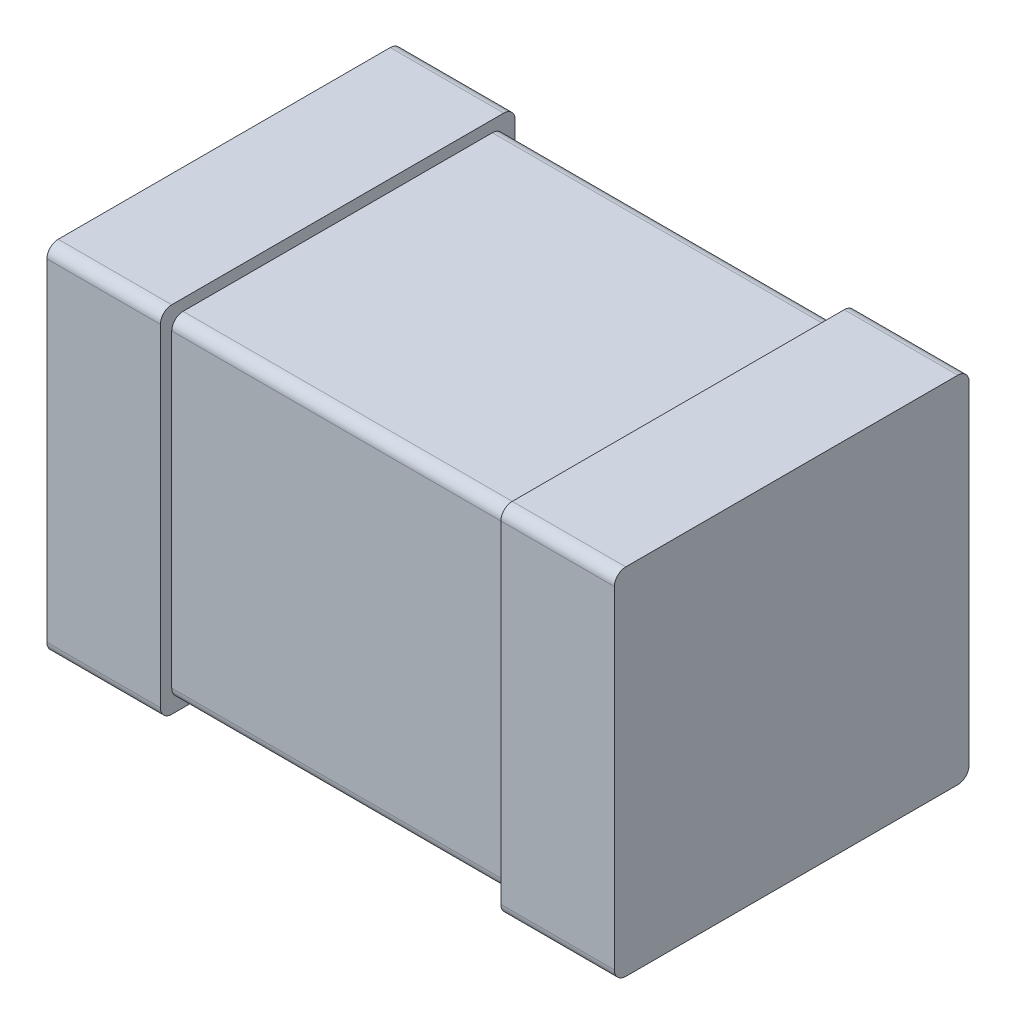
ISO-10303-21;
HEADER;
FILE_DESCRIPTION(('STEP AP214'),'2;1');
FILE_NAME('part.step','',(''),(''),'','','');
FILE_SCHEMA(('AUTOMOTIVE_DESIGN { 1 0 10303 214 1 1 1 1 }'));
ENDSEC;
DATA;
#1=APPLICATION_CONTEXT('core data for automotive mechanical design processes');
#2=APPLICATION_PROTOCOL_DEFINITION('international standard','automotive_design',2000,#1);
#3=PRODUCT_CONTEXT('',#1,'mechanical');
#4=PRODUCT('Part','Part','',(#3));
#5=PRODUCT_RELATED_PRODUCT_CATEGORY('part','',(#4));
#6=PRODUCT_DEFINITION_FORMATION('','',#4);
#7=PRODUCT_DEFINITION_CONTEXT('part definition',#1,'design');
#8=PRODUCT_DEFINITION('design','',#6,#7);
#9=PRODUCT_DEFINITION_SHAPE('','',#8);
#10=(LENGTH_UNIT() NAMED_UNIT(*) SI_UNIT(.MILLI.,.METRE.));
#11=(NAMED_UNIT(*) PLANE_ANGLE_UNIT() SI_UNIT($,.RADIAN.));
#12=(NAMED_UNIT(*) SI_UNIT($,.STERADIAN.) SOLID_ANGLE_UNIT());
#13=UNCERTAINTY_MEASURE_WITH_UNIT(LENGTH_MEASURE(1.E-05),#10,'distance_accuracy_value','');
#14=(GEOMETRIC_REPRESENTATION_CONTEXT(3) GLOBAL_UNCERTAINTY_ASSIGNED_CONTEXT((#13)) GLOBAL_UNIT_ASSIGNED_CONTEXT((#10,
#11,#12)) REPRESENTATION_CONTEXT('',''));
#15=CARTESIAN_POINT('',(0.,0.,0.));
#16=DIRECTION('',(0.,0.,1.));
#17=DIRECTION('',(1.,0.,0.));
#18=AXIS2_PLACEMENT_3D('',#15,#16,#17);
#19=CARTESIAN_POINT('',(1.,-0.625,0.));
#20=DIRECTION('',(1.,0.,0.));
#21=DIRECTION('',(0.,0.,-1.));
#22=AXIS2_PLACEMENT_3D('',#19,#20,#21);
#23=PLANE('',#22);
#24=DIRECTION('',(0.,1.,0.));
#25=VECTOR('',#24,1.);
#26=CARTESIAN_POINT('',(1.,-0.625,1.25));
#27=LINE('',#26,#25);
#28=CARTESIAN_POINT('',(1.,-0.585,1.25));
#29=VERTEX_POINT('',#28);
#30=CARTESIAN_POINT('',(1.,0.585,1.25));
#31=VERTEX_POINT('',#30);
#32=EDGE_CURVE('E200',#29,#31,#27,.T.);
#33=ORIENTED_EDGE('',*,*,#32,.F.);
#34=CARTESIAN_POINT('',(1.,-0.585,1.21));
#35=DIRECTION('',(1.,0.,0.));
#36=DIRECTION('',(0.,0.,-1.));
#37=AXIS2_PLACEMENT_3D('',#34,#35,#36);
#38=CIRCLE('',#37,0.04);
#39=CARTESIAN_POINT('',(1.,-0.625,1.21));
#40=VERTEX_POINT('',#39);
#41=EDGE_CURVE('E187',#40,#29,#38,.F.);
#42=ORIENTED_EDGE('',*,*,#41,.F.);
#43=DIRECTION('',(0.,0.,1.));
#44=VECTOR('',#43,1.);
#45=CARTESIAN_POINT('',(1.,-0.625,0.));
#46=LINE('',#45,#44);
#47=CARTESIAN_POINT('',(1.,-0.625,0.04));
#48=VERTEX_POINT('',#47);
#49=EDGE_CURVE('E184',#40,#48,#46,.F.);
#50=ORIENTED_EDGE('',*,*,#49,.T.);
#51=CARTESIAN_POINT('',(1.,-0.585,0.04));
#52=DIRECTION('',(1.,0.,0.));
#53=DIRECTION('',(0.,0.,-1.));
#54=AXIS2_PLACEMENT_3D('',#51,#52,#53);
#55=CIRCLE('',#54,0.04);
#56=CARTESIAN_POINT('',(1.,-0.585,0.));
#57=VERTEX_POINT('',#56);
#58=EDGE_CURVE('E20',#57,#48,#55,.F.);
#59=ORIENTED_EDGE('',*,*,#58,.F.);
#60=DIRECTION('',(0.,1.,0.));
#61=VECTOR('',#60,1.);
#62=CARTESIAN_POINT('',(1.,-0.625,0.));
#63=LINE('',#62,#61);
#64=CARTESIAN_POINT('',(1.,0.585,0.));
#65=VERTEX_POINT('',#64);
#66=EDGE_CURVE('E196',#57,#65,#63,.T.);
#67=ORIENTED_EDGE('',*,*,#66,.T.);
#68=CARTESIAN_POINT('',(1.,0.585,0.04));
#69=DIRECTION('',(1.,0.,0.));
#70=DIRECTION('',(0.,0.,-1.));
#71=AXIS2_PLACEMENT_3D('',#68,#69,#70);
#72=CIRCLE('',#71,0.04);
#73=CARTESIAN_POINT('',(1.,0.625,0.04));
#74=VERTEX_POINT('',#73);
#75=EDGE_CURVE('E208',#74,#65,#72,.F.);
#76=ORIENTED_EDGE('',*,*,#75,.F.);
#77=DIRECTION('',(0.,0.,1.));
#78=VECTOR('',#77,1.);
#79=CARTESIAN_POINT('',(1.,0.625,0.));
#80=LINE('',#79,#78);
#81=CARTESIAN_POINT('',(1.,0.625,1.21));
#82=VERTEX_POINT('',#81);
#83=EDGE_CURVE('E204',#82,#74,#80,.F.);
#84=ORIENTED_EDGE('',*,*,#83,.F.);
#85=CARTESIAN_POINT('',(1.,0.585,1.21));
#86=DIRECTION('',(1.,0.,0.));
#87=DIRECTION('',(0.,0.,-1.));
#88=AXIS2_PLACEMENT_3D('',#85,#86,#87);
#89=CIRCLE('',#88,0.04);
#90=EDGE_CURVE('E282',#31,#82,#89,.F.);
#91=ORIENTED_EDGE('',*,*,#90,.F.);
#92=EDGE_LOOP('',(#33,#42,#50,#59,#67,#76,#84,#91));
#93=FACE_BOUND('',#92,.T.);
#94=ADVANCED_FACE('F17',(#93),#23,.T.);
#95=CARTESIAN_POINT('',(0.6,-0.625,0.));
#96=DIRECTION('',(0.,1.,0.));
#97=DIRECTION('',(0.,0.,1.));
#98=AXIS2_PLACEMENT_3D('',#95,#96,#97);
#99=PLANE('',#98);
#100=DIRECTION('',(0.,0.,-1.));
#101=VECTOR('',#100,1.);
#102=CARTESIAN_POINT('',(0.6,-0.625,0.));
#103=LINE('',#102,#101);
#104=CARTESIAN_POINT('',(0.6,-0.625,1.21));
#105=VERTEX_POINT('',#104);
#106=CARTESIAN_POINT('',(0.6,-0.625,0.04));
#107=VERTEX_POINT('',#106);
#108=EDGE_CURVE('E194',#105,#107,#103,.T.);
#109=ORIENTED_EDGE('',*,*,#108,.T.);
#110=DIRECTION('',(1.,0.,0.));
#111=VECTOR('',#110,1.);
#112=CARTESIAN_POINT('',(0.6,-0.625,0.04));
#113=LINE('',#112,#111);
#114=EDGE_CURVE('E181',#48,#107,#113,.F.);
#115=ORIENTED_EDGE('',*,*,#114,.F.);
#116=ORIENTED_EDGE('',*,*,#49,.F.);
#117=DIRECTION('',(1.,0.,0.));
#118=VECTOR('',#117,1.);
#119=CARTESIAN_POINT('',(0.6,-0.625,1.21));
#120=LINE('',#119,#118);
#121=EDGE_CURVE('E281',#105,#40,#120,.T.);
#122=ORIENTED_EDGE('',*,*,#121,.F.);
#123=EDGE_LOOP('',(#109,#115,#116,#122));
#124=FACE_BOUND('',#123,.T.);
#125=ADVANCED_FACE('F193',(#124),#99,.F.);
#126=CARTESIAN_POINT('',(0.6,-0.585,0.04));
#127=DIRECTION('',(1.,0.,0.));
#128=DIRECTION('',(0.,0.,-1.));
#129=AXIS2_PLACEMENT_3D('',#126,#127,#128);
#130=CYLINDRICAL_SURFACE('',#129,0.04);
#131=ORIENTED_EDGE('',*,*,#58,.T.);
#132=ORIENTED_EDGE('',*,*,#114,.T.);
#133=CARTESIAN_POINT('',(0.6,-0.585,0.04));
#134=DIRECTION('',(1.,0.,0.));
#135=DIRECTION('',(0.,0.,-1.));
#136=AXIS2_PLACEMENT_3D('',#133,#134,#135);
#137=CIRCLE('',#136,0.04);
#138=CARTESIAN_POINT('',(0.6,-0.585,0.));
#139=VERTEX_POINT('',#138);
#140=EDGE_CURVE('E277',#107,#139,#137,.T.);
#141=ORIENTED_EDGE('',*,*,#140,.T.);
#142=DIRECTION('',(1.,0.,0.));
#143=VECTOR('',#142,1.);
#144=CARTESIAN_POINT('',(0.6,-0.585,0.));
#145=LINE('',#144,#143);
#146=EDGE_CURVE('E183',#139,#57,#145,.T.);
#147=ORIENTED_EDGE('',*,*,#146,.T.);
#148=EDGE_LOOP('',(#131,#132,#141,#147));
#149=FACE_BOUND('',#148,.T.);
#150=ADVANCED_FACE('F178',(#149),#130,.T.);
#151=CARTESIAN_POINT('',(0.6,-0.625,0.));
#152=DIRECTION('',(0.,0.,1.));
#153=DIRECTION('',(1.,0.,0.));
#154=AXIS2_PLACEMENT_3D('',#151,#152,#153);
#155=PLANE('',#154);
#156=ORIENTED_EDGE('',*,*,#66,.F.);
#157=ORIENTED_EDGE('',*,*,#146,.F.);
#158=DIRECTION('',(0.,1.,0.));
#159=VECTOR('',#158,1.);
#160=CARTESIAN_POINT('',(0.6,-0.625,0.));
#161=LINE('',#160,#159);
#162=CARTESIAN_POINT('',(0.6,0.585,0.));
#163=VERTEX_POINT('',#162);
#164=EDGE_CURVE('E276',#139,#163,#161,.T.);
#165=ORIENTED_EDGE('',*,*,#164,.T.);
#166=DIRECTION('',(1.,0.,0.));
#167=VECTOR('',#166,1.);
#168=CARTESIAN_POINT('',(0.6,0.585,0.));
#169=LINE('',#168,#167);
#170=EDGE_CURVE('E207',#65,#163,#169,.F.);
#171=ORIENTED_EDGE('',*,*,#170,.F.);
#172=EDGE_LOOP('',(#156,#157,#165,#171));
#173=FACE_BOUND('',#172,.T.);
#174=ADVANCED_FACE('F474',(#173),#155,.F.);
#175=CARTESIAN_POINT('',(0.6,0.585,0.04));
#176=DIRECTION('',(1.,0.,0.));
#177=DIRECTION('',(0.,0.,-1.));
#178=AXIS2_PLACEMENT_3D('',#175,#176,#177);
#179=CYLINDRICAL_SURFACE('',#178,0.04);
#180=ORIENTED_EDGE('',*,*,#170,.T.);
#181=CARTESIAN_POINT('',(0.6,0.585,0.04));
#182=DIRECTION('',(1.,0.,0.));
#183=DIRECTION('',(0.,0.,-1.));
#184=AXIS2_PLACEMENT_3D('',#181,#182,#183);
#185=CIRCLE('',#184,0.04);
#186=CARTESIAN_POINT('',(0.6,0.625,0.04));
#187=VERTEX_POINT('',#186);
#188=EDGE_CURVE('E273',#163,#187,#185,.T.);
#189=ORIENTED_EDGE('',*,*,#188,.T.);
#190=DIRECTION('',(1.,0.,0.));
#191=VECTOR('',#190,1.);
#192=CARTESIAN_POINT('',(0.6,0.625,0.04));
#193=LINE('',#192,#191);
#194=EDGE_CURVE('E206',#74,#187,#193,.F.);
#195=ORIENTED_EDGE('',*,*,#194,.F.);
#196=ORIENTED_EDGE('',*,*,#75,.T.);
#197=EDGE_LOOP('',(#180,#189,#195,#196));
#198=FACE_BOUND('',#197,.T.);
#199=ADVANCED_FACE('F470',(#198),#179,.T.);
#200=CARTESIAN_POINT('',(0.6,0.625,0.));
#201=DIRECTION('',(0.,1.,0.));
#202=DIRECTION('',(0.,0.,1.));
#203=AXIS2_PLACEMENT_3D('',#200,#201,#202);
#204=PLANE('',#203);
#205=DIRECTION('',(0.,0.,-1.));
#206=VECTOR('',#205,1.);
#207=CARTESIAN_POINT('',(0.6,0.625,0.));
#208=LINE('',#207,#206);
#209=CARTESIAN_POINT('',(0.6,0.625,1.21));
#210=VERTEX_POINT('',#209);
#211=EDGE_CURVE('E272',#187,#210,#208,.F.);
#212=ORIENTED_EDGE('',*,*,#211,.T.);
#213=DIRECTION('',(1.,0.,0.));
#214=VECTOR('',#213,1.);
#215=CARTESIAN_POINT('',(0.6,0.625,1.21));
#216=LINE('',#215,#214);
#217=EDGE_CURVE('E202',#82,#210,#216,.F.);
#218=ORIENTED_EDGE('',*,*,#217,.F.);
#219=ORIENTED_EDGE('',*,*,#83,.T.);
#220=ORIENTED_EDGE('',*,*,#194,.T.);
#221=EDGE_LOOP('',(#212,#218,#219,#220));
#222=FACE_BOUND('',#221,.T.);
#223=ADVANCED_FACE('F466',(#222),#204,.T.);
#224=CARTESIAN_POINT('',(0.6,0.585,1.21));
#225=DIRECTION('',(1.,0.,0.));
#226=DIRECTION('',(0.,0.,-1.));
#227=AXIS2_PLACEMENT_3D('',#224,#225,#226);
#228=CYLINDRICAL_SURFACE('',#227,0.04);
#229=ORIENTED_EDGE('',*,*,#90,.T.);
#230=ORIENTED_EDGE('',*,*,#217,.T.);
#231=CARTESIAN_POINT('',(0.6,0.585,1.21));
#232=DIRECTION('',(1.,0.,0.));
#233=DIRECTION('',(0.,0.,-1.));
#234=AXIS2_PLACEMENT_3D('',#231,#232,#233);
#235=CIRCLE('',#234,0.04);
#236=CARTESIAN_POINT('',(0.6,0.585,1.25));
#237=VERTEX_POINT('',#236);
#238=EDGE_CURVE('E269',#210,#237,#235,.T.);
#239=ORIENTED_EDGE('',*,*,#238,.T.);
#240=DIRECTION('',(1.,0.,0.));
#241=VECTOR('',#240,1.);
#242=CARTESIAN_POINT('',(0.6,0.585,1.25));
#243=LINE('',#242,#241);
#244=EDGE_CURVE('E201',#31,#237,#243,.F.);
#245=ORIENTED_EDGE('',*,*,#244,.F.);
#246=EDGE_LOOP('',(#229,#230,#239,#245));
#247=FACE_BOUND('',#246,.T.);
#248=ADVANCED_FACE('F462',(#247),#228,.T.);
#249=CARTESIAN_POINT('',(0.6,-0.625,1.25));
#250=DIRECTION('',(0.,0.,1.));
#251=DIRECTION('',(1.,0.,0.));
#252=AXIS2_PLACEMENT_3D('',#249,#250,#251);
#253=PLANE('',#252);
#254=ORIENTED_EDGE('',*,*,#32,.T.);
#255=ORIENTED_EDGE('',*,*,#244,.T.);
#256=DIRECTION('',(0.,1.,0.));
#257=VECTOR('',#256,1.);
#258=CARTESIAN_POINT('',(0.6,-0.625,1.25));
#259=LINE('',#258,#257);
#260=CARTESIAN_POINT('',(0.6,-0.585,1.25));
#261=VERTEX_POINT('',#260);
#262=EDGE_CURVE('E268',#237,#261,#259,.F.);
#263=ORIENTED_EDGE('',*,*,#262,.T.);
#264=DIRECTION('',(1.,0.,0.));
#265=VECTOR('',#264,1.);
#266=CARTESIAN_POINT('',(0.6,-0.585,1.25));
#267=LINE('',#266,#265);
#268=EDGE_CURVE('E280',#29,#261,#267,.F.);
#269=ORIENTED_EDGE('',*,*,#268,.F.);
#270=EDGE_LOOP('',(#254,#255,#263,#269));
#271=FACE_BOUND('',#270,.T.);
#272=ADVANCED_FACE('F458',(#271),#253,.T.);
#273=CARTESIAN_POINT('',(0.6,-0.585,1.21));
#274=DIRECTION('',(1.,0.,0.));
#275=DIRECTION('',(0.,0.,-1.));
#276=AXIS2_PLACEMENT_3D('',#273,#274,#275);
#277=CYLINDRICAL_SURFACE('',#276,0.04);
#278=ORIENTED_EDGE('',*,*,#268,.T.);
#279=CARTESIAN_POINT('',(0.6,-0.585,1.21));
#280=DIRECTION('',(1.,0.,0.));
#281=DIRECTION('',(0.,0.,-1.));
#282=AXIS2_PLACEMENT_3D('',#279,#280,#281);
#283=CIRCLE('',#282,0.04);
#284=EDGE_CURVE('E265',#261,#105,#283,.T.);
#285=ORIENTED_EDGE('',*,*,#284,.T.);
#286=ORIENTED_EDGE('',*,*,#121,.T.);
#287=ORIENTED_EDGE('',*,*,#41,.T.);
#288=EDGE_LOOP('',(#278,#285,#286,#287));
#289=FACE_BOUND('',#288,.T.);
#290=ADVANCED_FACE('F454',(#289),#277,.T.);
#291=CARTESIAN_POINT('',(0.6,-0.625,0.));
#292=DIRECTION('',(1.,0.,0.));
#293=DIRECTION('',(0.,0.,-1.));
#294=AXIS2_PLACEMENT_3D('',#291,#292,#293);
#295=PLANE('',#294);
#296=CARTESIAN_POINT('',(0.6,0.545,0.08));
#297=DIRECTION('',(1.,0.,0.));
#298=DIRECTION('',(0.,0.,-1.));
#299=AXIS2_PLACEMENT_3D('',#296,#297,#298);
#300=CIRCLE('',#299,0.04);
#301=CARTESIAN_POINT('',(0.6,0.585,0.08));
#302=VERTEX_POINT('',#301);
#303=CARTESIAN_POINT('',(0.6,0.545,0.04));
#304=VERTEX_POINT('',#303);
#305=EDGE_CURVE('E250',#302,#304,#300,.F.);
#306=ORIENTED_EDGE('',*,*,#305,.F.);
#307=DIRECTION('',(0.,0.,1.));
#308=VECTOR('',#307,1.);
#309=CARTESIAN_POINT('',(0.6,0.585,0.04));
#310=LINE('',#309,#308);
#311=CARTESIAN_POINT('',(0.6,0.585,1.17));
#312=VERTEX_POINT('',#311);
#313=EDGE_CURVE('E256',#312,#302,#310,.F.);
#314=ORIENTED_EDGE('',*,*,#313,.F.);
#315=CARTESIAN_POINT('',(0.6,0.545,1.17));
#316=DIRECTION('',(1.,0.,0.));
#317=DIRECTION('',(0.,0.,-1.));
#318=AXIS2_PLACEMENT_3D('',#315,#316,#317);
#319=CIRCLE('',#318,0.04);
#320=CARTESIAN_POINT('',(0.6,0.545,1.21));
#321=VERTEX_POINT('',#320);
#322=EDGE_CURVE('E254',#321,#312,#319,.F.);
#323=ORIENTED_EDGE('',*,*,#322,.F.);
#324=DIRECTION('',(0.,1.,0.));
#325=VECTOR('',#324,1.);
#326=CARTESIAN_POINT('',(0.6,-0.585,1.21));
#327=LINE('',#326,#325);
#328=CARTESIAN_POINT('',(0.6,-0.545,1.21));
#329=VERTEX_POINT('',#328);
#330=EDGE_CURVE('E297',#329,#321,#327,.T.);
#331=ORIENTED_EDGE('',*,*,#330,.F.);
#332=CARTESIAN_POINT('',(0.6,-0.545,1.17));
#333=DIRECTION('',(1.,0.,0.));
#334=DIRECTION('',(0.,0.,-1.));
#335=AXIS2_PLACEMENT_3D('',#332,#333,#334);
#336=CIRCLE('',#335,0.04);
#337=CARTESIAN_POINT('',(0.6,-0.585,1.17));
#338=VERTEX_POINT('',#337);
#339=EDGE_CURVE('E258',#338,#329,#336,.F.);
#340=ORIENTED_EDGE('',*,*,#339,.F.);
#341=DIRECTION('',(0.,0.,1.));
#342=VECTOR('',#341,1.);
#343=CARTESIAN_POINT('',(0.6,-0.585,0.04));
#344=LINE('',#343,#342);
#345=CARTESIAN_POINT('',(0.6,-0.585,0.08));
#346=VERTEX_POINT('',#345);
#347=EDGE_CURVE('E264',#338,#346,#344,.F.);
#348=ORIENTED_EDGE('',*,*,#347,.T.);
#349=CARTESIAN_POINT('',(0.6,-0.545,0.08));
#350=DIRECTION('',(1.,0.,0.));
#351=DIRECTION('',(0.,0.,-1.));
#352=AXIS2_PLACEMENT_3D('',#349,#350,#351);
#353=CIRCLE('',#352,0.04);
#354=CARTESIAN_POINT('',(0.6,-0.545,0.04));
#355=VERTEX_POINT('',#354);
#356=EDGE_CURVE('E262',#355,#346,#353,.F.);
#357=ORIENTED_EDGE('',*,*,#356,.F.);
#358=DIRECTION('',(0.,1.,0.));
#359=VECTOR('',#358,1.);
#360=CARTESIAN_POINT('',(0.6,-0.585,0.04));
#361=LINE('',#360,#359);
#362=EDGE_CURVE('E308',#355,#304,#361,.T.);
#363=ORIENTED_EDGE('',*,*,#362,.T.);
#364=EDGE_LOOP('',(#306,#314,#323,#331,#340,#348,#357,#363));
#365=FACE_BOUND('',#364,.T.);
#366=ORIENTED_EDGE('',*,*,#262,.F.);
#367=ORIENTED_EDGE('',*,*,#238,.F.);
#368=ORIENTED_EDGE('',*,*,#211,.F.);
#369=ORIENTED_EDGE('',*,*,#188,.F.);
#370=ORIENTED_EDGE('',*,*,#164,.F.);
#371=ORIENTED_EDGE('',*,*,#140,.F.);
#372=ORIENTED_EDGE('',*,*,#108,.F.);
#373=ORIENTED_EDGE('',*,*,#284,.F.);
#374=EDGE_LOOP('',(#366,#367,#368,#369,#370,#371,#372,#373));
#375=FACE_BOUND('',#374,.T.);
#376=ADVANCED_FACE('F450',(#365,#375),#295,.F.);
#377=CARTESIAN_POINT('',(-0.6,-0.545,0.08));
#378=DIRECTION('',(1.,0.,0.));
#379=DIRECTION('',(0.,0.,-1.));
#380=AXIS2_PLACEMENT_3D('',#377,#378,#379);
#381=CYLINDRICAL_SURFACE('',#380,0.04);
#382=ORIENTED_EDGE('',*,*,#356,.T.);
#383=DIRECTION('',(1.,0.,0.));
#384=VECTOR('',#383,1.);
#385=CARTESIAN_POINT('',(-0.6,-0.585,0.08));
#386=LINE('',#385,#384);
#387=CARTESIAN_POINT('',(-0.6,-0.585,0.08));
#388=VERTEX_POINT('',#387);
#389=EDGE_CURVE('E296',#346,#388,#386,.F.);
#390=ORIENTED_EDGE('',*,*,#389,.T.);
#391=CARTESIAN_POINT('',(-0.6,-0.545,0.08));
#392=DIRECTION('',(1.,0.,0.));
#393=DIRECTION('',(0.,0.,-1.));
#394=AXIS2_PLACEMENT_3D('',#391,#392,#393);
#395=CIRCLE('',#394,0.04);
#396=CARTESIAN_POINT('',(-0.6,-0.545,0.04));
#397=VERTEX_POINT('',#396);
#398=EDGE_CURVE('E247',#397,#388,#395,.F.);
#399=ORIENTED_EDGE('',*,*,#398,.F.);
#400=DIRECTION('',(1.,0.,0.));
#401=VECTOR('',#400,1.);
#402=CARTESIAN_POINT('',(-0.6,-0.545,0.04));
#403=LINE('',#402,#401);
#404=EDGE_CURVE('E252',#397,#355,#403,.T.);
#405=ORIENTED_EDGE('',*,*,#404,.T.);
#406=EDGE_LOOP('',(#382,#390,#399,#405));
#407=FACE_BOUND('',#406,.T.);
#408=ADVANCED_FACE('F446',(#407),#381,.T.);
#409=CARTESIAN_POINT('',(-0.6,-0.585,0.04));
#410=DIRECTION('',(0.,1.,0.));
#411=DIRECTION('',(0.,0.,1.));
#412=AXIS2_PLACEMENT_3D('',#409,#410,#411);
#413=PLANE('',#412);
#414=DIRECTION('',(0.,0.,-1.));
#415=VECTOR('',#414,1.);
#416=CARTESIAN_POINT('',(-0.6,-0.585,0.));
#417=LINE('',#416,#415);
#418=CARTESIAN_POINT('',(-0.6,-0.585,1.17));
#419=VERTEX_POINT('',#418);
#420=EDGE_CURVE('E246',#388,#419,#417,.F.);
#421=ORIENTED_EDGE('',*,*,#420,.F.);
#422=ORIENTED_EDGE('',*,*,#389,.F.);
#423=ORIENTED_EDGE('',*,*,#347,.F.);
#424=DIRECTION('',(1.,0.,0.));
#425=VECTOR('',#424,1.);
#426=CARTESIAN_POINT('',(-0.6,-0.585,1.17));
#427=LINE('',#426,#425);
#428=EDGE_CURVE('E261',#419,#338,#427,.T.);
#429=ORIENTED_EDGE('',*,*,#428,.F.);
#430=EDGE_LOOP('',(#421,#422,#423,#429));
#431=FACE_BOUND('',#430,.T.);
#432=ADVANCED_FACE('F442',(#431),#413,.F.);
#433=CARTESIAN_POINT('',(-0.6,-0.545,1.17));
#434=DIRECTION('',(1.,0.,0.));
#435=DIRECTION('',(0.,0.,-1.));
#436=AXIS2_PLACEMENT_3D('',#433,#434,#435);
#437=CYLINDRICAL_SURFACE('',#436,0.04);
#438=DIRECTION('',(1.,0.,0.));
#439=VECTOR('',#438,1.);
#440=CARTESIAN_POINT('',(-0.6,-0.545,1.21));
#441=LINE('',#440,#439);
#442=CARTESIAN_POINT('',(-0.6,-0.545,1.21));
#443=VERTEX_POINT('',#442);
#444=EDGE_CURVE('E260',#443,#329,#441,.T.);
#445=ORIENTED_EDGE('',*,*,#444,.F.);
#446=CARTESIAN_POINT('',(-0.6,-0.545,1.17));
#447=DIRECTION('',(1.,0.,0.));
#448=DIRECTION('',(0.,0.,-1.));
#449=AXIS2_PLACEMENT_3D('',#446,#447,#448);
#450=CIRCLE('',#449,0.04);
#451=EDGE_CURVE('E244',#419,#443,#450,.F.);
#452=ORIENTED_EDGE('',*,*,#451,.F.);
#453=ORIENTED_EDGE('',*,*,#428,.T.);
#454=ORIENTED_EDGE('',*,*,#339,.T.);
#455=EDGE_LOOP('',(#445,#452,#453,#454));
#456=FACE_BOUND('',#455,.T.);
#457=ADVANCED_FACE('F438',(#456),#437,.T.);
#458=CARTESIAN_POINT('',(-0.6,-0.585,1.21));
#459=DIRECTION('',(0.,0.,1.));
#460=DIRECTION('',(1.,0.,0.));
#461=AXIS2_PLACEMENT_3D('',#458,#459,#460);
#462=PLANE('',#461);
#463=ORIENTED_EDGE('',*,*,#330,.T.);
#464=DIRECTION('',(1.,0.,0.));
#465=VECTOR('',#464,1.);
#466=CARTESIAN_POINT('',(-0.6,0.545,1.21));
#467=LINE('',#466,#465);
#468=CARTESIAN_POINT('',(-0.6,0.545,1.21));
#469=VERTEX_POINT('',#468);
#470=EDGE_CURVE('E257',#469,#321,#467,.T.);
#471=ORIENTED_EDGE('',*,*,#470,.F.);
#472=DIRECTION('',(0.,1.,0.));
#473=VECTOR('',#472,1.);
#474=CARTESIAN_POINT('',(-0.6,-0.625,1.21));
#475=LINE('',#474,#473);
#476=EDGE_CURVE('E243',#443,#469,#475,.T.);
#477=ORIENTED_EDGE('',*,*,#476,.F.);
#478=ORIENTED_EDGE('',*,*,#444,.T.);
#479=EDGE_LOOP('',(#463,#471,#477,#478));
#480=FACE_BOUND('',#479,.T.);
#481=ADVANCED_FACE('F434',(#480),#462,.T.);
#482=CARTESIAN_POINT('',(-0.6,0.545,1.17));
#483=DIRECTION('',(1.,0.,0.));
#484=DIRECTION('',(0.,0.,-1.));
#485=AXIS2_PLACEMENT_3D('',#482,#483,#484);
#486=CYLINDRICAL_SURFACE('',#485,0.04);
#487=ORIENTED_EDGE('',*,*,#322,.T.);
#488=DIRECTION('',(1.,0.,0.));
#489=VECTOR('',#488,1.);
#490=CARTESIAN_POINT('',(-0.6,0.585,1.17));
#491=LINE('',#490,#489);
#492=CARTESIAN_POINT('',(-0.6,0.585,1.17));
#493=VERTEX_POINT('',#492);
#494=EDGE_CURVE('E300',#493,#312,#491,.T.);
#495=ORIENTED_EDGE('',*,*,#494,.F.);
#496=CARTESIAN_POINT('',(-0.6,0.545,1.17));
#497=DIRECTION('',(1.,0.,0.));
#498=DIRECTION('',(0.,0.,-1.));
#499=AXIS2_PLACEMENT_3D('',#496,#497,#498);
#500=CIRCLE('',#499,0.04);
#501=EDGE_CURVE('E241',#469,#493,#500,.F.);
#502=ORIENTED_EDGE('',*,*,#501,.F.);
#503=ORIENTED_EDGE('',*,*,#470,.T.);
#504=EDGE_LOOP('',(#487,#495,#502,#503));
#505=FACE_BOUND('',#504,.T.);
#506=ADVANCED_FACE('F430',(#505),#486,.T.);
#507=CARTESIAN_POINT('',(-0.6,0.585,0.04));
#508=DIRECTION('',(0.,1.,0.));
#509=DIRECTION('',(0.,0.,1.));
#510=AXIS2_PLACEMENT_3D('',#507,#508,#509);
#511=PLANE('',#510);
#512=DIRECTION('',(0.,0.,-1.));
#513=VECTOR('',#512,1.);
#514=CARTESIAN_POINT('',(-0.6,0.585,0.));
#515=LINE('',#514,#513);
#516=CARTESIAN_POINT('',(-0.6,0.585,0.08));
#517=VERTEX_POINT('',#516);
#518=EDGE_CURVE('E240',#493,#517,#515,.T.);
#519=ORIENTED_EDGE('',*,*,#518,.F.);
#520=ORIENTED_EDGE('',*,*,#494,.T.);
#521=ORIENTED_EDGE('',*,*,#313,.T.);
#522=DIRECTION('',(1.,0.,0.));
#523=VECTOR('',#522,1.);
#524=CARTESIAN_POINT('',(-0.6,0.585,0.08));
#525=LINE('',#524,#523);
#526=EDGE_CURVE('E253',#517,#302,#525,.T.);
#527=ORIENTED_EDGE('',*,*,#526,.F.);
#528=EDGE_LOOP('',(#519,#520,#521,#527));
#529=FACE_BOUND('',#528,.T.);
#530=ADVANCED_FACE('F426',(#529),#511,.T.);
#531=CARTESIAN_POINT('',(-0.6,0.545,0.08));
#532=DIRECTION('',(1.,0.,0.));
#533=DIRECTION('',(0.,0.,-1.));
#534=AXIS2_PLACEMENT_3D('',#531,#532,#533);
#535=CYLINDRICAL_SURFACE('',#534,0.04);
#536=DIRECTION('',(1.,0.,0.));
#537=VECTOR('',#536,1.);
#538=CARTESIAN_POINT('',(-0.6,0.545,0.04));
#539=LINE('',#538,#537);
#540=CARTESIAN_POINT('',(-0.6,0.545,0.04));
#541=VERTEX_POINT('',#540);
#542=EDGE_CURVE('E249',#304,#541,#539,.F.);
#543=ORIENTED_EDGE('',*,*,#542,.T.);
#544=CARTESIAN_POINT('',(-0.6,0.545,0.08));
#545=DIRECTION('',(1.,0.,0.));
#546=DIRECTION('',(0.,0.,-1.));
#547=AXIS2_PLACEMENT_3D('',#544,#545,#546);
#548=CIRCLE('',#547,0.04);
#549=EDGE_CURVE('E237',#517,#541,#548,.F.);
#550=ORIENTED_EDGE('',*,*,#549,.F.);
#551=ORIENTED_EDGE('',*,*,#526,.T.);
#552=ORIENTED_EDGE('',*,*,#305,.T.);
#553=EDGE_LOOP('',(#543,#550,#551,#552));
#554=FACE_BOUND('',#553,.T.);
#555=ADVANCED_FACE('F422',(#554),#535,.T.);
#556=CARTESIAN_POINT('',(-0.6,-0.585,0.04));
#557=DIRECTION('',(0.,0.,1.));
#558=DIRECTION('',(1.,0.,0.));
#559=AXIS2_PLACEMENT_3D('',#556,#557,#558);
#560=PLANE('',#559);
#561=ORIENTED_EDGE('',*,*,#362,.F.);
#562=ORIENTED_EDGE('',*,*,#404,.F.);
#563=DIRECTION('',(0.,1.,0.));
#564=VECTOR('',#563,1.);
#565=CARTESIAN_POINT('',(-0.6,-0.625,0.04));
#566=LINE('',#565,#564);
#567=EDGE_CURVE('E239',#541,#397,#566,.F.);
#568=ORIENTED_EDGE('',*,*,#567,.F.);
#569=ORIENTED_EDGE('',*,*,#542,.F.);
#570=EDGE_LOOP('',(#561,#562,#568,#569));
#571=FACE_BOUND('',#570,.T.);
#572=ADVANCED_FACE('F418',(#571),#560,.F.);
#573=CARTESIAN_POINT('',(-0.6,-0.625,0.));
#574=DIRECTION('',(1.,0.,0.));
#575=DIRECTION('',(0.,0.,-1.));
#576=AXIS2_PLACEMENT_3D('',#573,#574,#575);
#577=PLANE('',#576);
#578=ORIENTED_EDGE('',*,*,#549,.T.);
#579=ORIENTED_EDGE('',*,*,#567,.T.);
#580=ORIENTED_EDGE('',*,*,#398,.T.);
#581=ORIENTED_EDGE('',*,*,#420,.T.);
#582=ORIENTED_EDGE('',*,*,#451,.T.);
#583=ORIENTED_EDGE('',*,*,#476,.T.);
#584=ORIENTED_EDGE('',*,*,#501,.T.);
#585=ORIENTED_EDGE('',*,*,#518,.T.);
#586=EDGE_LOOP('',(#578,#579,#580,#581,#582,#583,#584,#585));
#587=FACE_BOUND('',#586,.T.);
#588=DIRECTION('',(0.,1.,0.));
#589=VECTOR('',#588,1.);
#590=CARTESIAN_POINT('',(-0.6,-0.625,1.25));
#591=LINE('',#590,#589);
#592=CARTESIAN_POINT('',(-0.6,-0.585,1.25));
#593=VERTEX_POINT('',#592);
#594=CARTESIAN_POINT('',(-0.6,0.585,1.25));
#595=VERTEX_POINT('',#594);
#596=EDGE_CURVE('E339',#593,#595,#591,.T.);
#597=ORIENTED_EDGE('',*,*,#596,.F.);
#598=CARTESIAN_POINT('',(-0.6,-0.585,1.21));
#599=DIRECTION('',(1.,0.,0.));
#600=DIRECTION('',(0.,0.,-1.));
#601=AXIS2_PLACEMENT_3D('',#598,#599,#600);
#602=CIRCLE('',#601,0.04);
#603=CARTESIAN_POINT('',(-0.6,-0.625,1.21));
#604=VERTEX_POINT('',#603);
#605=EDGE_CURVE('E222',#604,#593,#602,.F.);
#606=ORIENTED_EDGE('',*,*,#605,.F.);
#607=DIRECTION('',(0.,0.,1.));
#608=VECTOR('',#607,1.);
#609=CARTESIAN_POINT('',(-0.6,-0.625,0.));
#610=LINE('',#609,#608);
#611=CARTESIAN_POINT('',(-0.6,-0.625,0.04));
#612=VERTEX_POINT('',#611);
#613=EDGE_CURVE('E236',#604,#612,#610,.F.);
#614=ORIENTED_EDGE('',*,*,#613,.T.);
#615=CARTESIAN_POINT('',(-0.6,-0.585,0.04));
#616=DIRECTION('',(1.,0.,0.));
#617=DIRECTION('',(0.,0.,-1.));
#618=AXIS2_PLACEMENT_3D('',#615,#616,#617);
#619=CIRCLE('',#618,0.04);
#620=CARTESIAN_POINT('',(-0.6,-0.585,0.));
#621=VERTEX_POINT('',#620);
#622=EDGE_CURVE('E233',#621,#612,#619,.F.);
#623=ORIENTED_EDGE('',*,*,#622,.F.);
#624=DIRECTION('',(0.,1.,0.));
#625=VECTOR('',#624,1.);
#626=CARTESIAN_POINT('',(-0.6,-0.625,0.));
#627=LINE('',#626,#625);
#628=CARTESIAN_POINT('',(-0.6,0.585,0.));
#629=VERTEX_POINT('',#628);
#630=EDGE_CURVE('E232',#621,#629,#627,.T.);
#631=ORIENTED_EDGE('',*,*,#630,.T.);
#632=CARTESIAN_POINT('',(-0.6,0.585,0.04));
#633=DIRECTION('',(1.,0.,0.));
#634=DIRECTION('',(0.,0.,-1.));
#635=AXIS2_PLACEMENT_3D('',#632,#633,#634);
#636=CIRCLE('',#635,0.04);
#637=CARTESIAN_POINT('',(-0.6,0.625,0.04));
#638=VERTEX_POINT('',#637);
#639=EDGE_CURVE('E229',#638,#629,#636,.F.);
#640=ORIENTED_EDGE('',*,*,#639,.F.);
#641=DIRECTION('',(0.,0.,1.));
#642=VECTOR('',#641,1.);
#643=CARTESIAN_POINT('',(-0.6,0.625,0.));
#644=LINE('',#643,#642);
#645=CARTESIAN_POINT('',(-0.6,0.625,1.21));
#646=VERTEX_POINT('',#645);
#647=EDGE_CURVE('E330',#646,#638,#644,.F.);
#648=ORIENTED_EDGE('',*,*,#647,.F.);
#649=CARTESIAN_POINT('',(-0.6,0.585,1.21));
#650=DIRECTION('',(1.,0.,0.));
#651=DIRECTION('',(0.,0.,-1.));
#652=AXIS2_PLACEMENT_3D('',#649,#650,#651);
#653=CIRCLE('',#652,0.04);
#654=EDGE_CURVE('E225',#595,#646,#653,.F.);
#655=ORIENTED_EDGE('',*,*,#654,.F.);
#656=EDGE_LOOP('',(#597,#606,#614,#623,#631,#640,#648,#655));
#657=FACE_BOUND('',#656,.T.);
#658=ADVANCED_FACE('F415',(#587,#657),#577,.T.);
#659=CARTESIAN_POINT('',(-1.,-0.625,0.));
#660=DIRECTION('',(0.,1.,0.));
#661=DIRECTION('',(0.,0.,1.));
#662=AXIS2_PLACEMENT_3D('',#659,#660,#661);
#663=PLANE('',#662);
#664=DIRECTION('',(0.,0.,-1.));
#665=VECTOR('',#664,1.);
#666=CARTESIAN_POINT('',(-1.,-0.625,0.));
#667=LINE('',#666,#665);
#668=CARTESIAN_POINT('',(-1.,-0.625,1.21));
#669=VERTEX_POINT('',#668);
#670=CARTESIAN_POINT('',(-1.,-0.625,0.04));
#671=VERTEX_POINT('',#670);
#672=EDGE_CURVE('E221',#669,#671,#667,.T.);
#673=ORIENTED_EDGE('',*,*,#672,.T.);
#674=DIRECTION('',(1.,0.,0.));
#675=VECTOR('',#674,1.);
#676=CARTESIAN_POINT('',(-1.,-0.625,0.04));
#677=LINE('',#676,#675);
#678=EDGE_CURVE('E235',#612,#671,#677,.F.);
#679=ORIENTED_EDGE('',*,*,#678,.F.);
#680=ORIENTED_EDGE('',*,*,#613,.F.);
#681=DIRECTION('',(1.,0.,0.));
#682=VECTOR('',#681,1.);
#683=CARTESIAN_POINT('',(-1.,-0.625,1.21));
#684=LINE('',#683,#682);
#685=EDGE_CURVE('E224',#669,#604,#684,.T.);
#686=ORIENTED_EDGE('',*,*,#685,.F.);
#687=EDGE_LOOP('',(#673,#679,#680,#686));
#688=FACE_BOUND('',#687,.T.);
#689=ADVANCED_FACE('F389',(#688),#663,.F.);
#690=CARTESIAN_POINT('',(-1.,-0.585,0.04));
#691=DIRECTION('',(1.,0.,0.));
#692=DIRECTION('',(0.,0.,-1.));
#693=AXIS2_PLACEMENT_3D('',#690,#691,#692);
#694=CYLINDRICAL_SURFACE('',#693,0.04);
#695=ORIENTED_EDGE('',*,*,#622,.T.);
#696=ORIENTED_EDGE('',*,*,#678,.T.);
#697=CARTESIAN_POINT('',(-1.,-0.585,0.04));
#698=DIRECTION('',(1.,0.,0.));
#699=DIRECTION('',(0.,0.,-1.));
#700=AXIS2_PLACEMENT_3D('',#697,#698,#699);
#701=CIRCLE('',#700,0.04);
#702=CARTESIAN_POINT('',(-1.,-0.585,0.));
#703=VERTEX_POINT('',#702);
#704=EDGE_CURVE('E218',#671,#703,#701,.T.);
#705=ORIENTED_EDGE('',*,*,#704,.T.);
#706=DIRECTION('',(1.,0.,0.));
#707=VECTOR('',#706,1.);
#708=CARTESIAN_POINT('',(-1.,-0.585,0.));
#709=LINE('',#708,#707);
#710=EDGE_CURVE('E329',#703,#621,#709,.T.);
#711=ORIENTED_EDGE('',*,*,#710,.T.);
#712=EDGE_LOOP('',(#695,#696,#705,#711));
#713=FACE_BOUND('',#712,.T.);
#714=ADVANCED_FACE('F386',(#713),#694,.T.);
#715=CARTESIAN_POINT('',(-1.,-0.625,0.));
#716=DIRECTION('',(0.,0.,1.));
#717=DIRECTION('',(1.,0.,0.));
#718=AXIS2_PLACEMENT_3D('',#715,#716,#717);
#719=PLANE('',#718);
#720=ORIENTED_EDGE('',*,*,#630,.F.);
#721=ORIENTED_EDGE('',*,*,#710,.F.);
#722=DIRECTION('',(0.,1.,0.));
#723=VECTOR('',#722,1.);
#724=CARTESIAN_POINT('',(-1.,-0.625,0.));
#725=LINE('',#724,#723);
#726=CARTESIAN_POINT('',(-1.,0.585,0.));
#727=VERTEX_POINT('',#726);
#728=EDGE_CURVE('E217',#703,#727,#725,.T.);
#729=ORIENTED_EDGE('',*,*,#728,.T.);
#730=DIRECTION('',(1.,0.,0.));
#731=VECTOR('',#730,1.);
#732=CARTESIAN_POINT('',(-1.,0.585,0.));
#733=LINE('',#732,#731);
#734=EDGE_CURVE('E231',#629,#727,#733,.F.);
#735=ORIENTED_EDGE('',*,*,#734,.F.);
#736=EDGE_LOOP('',(#720,#721,#729,#735));
#737=FACE_BOUND('',#736,.T.);
#738=ADVANCED_FACE('F383',(#737),#719,.F.);
#739=CARTESIAN_POINT('',(-1.,0.585,0.04));
#740=DIRECTION('',(1.,0.,0.));
#741=DIRECTION('',(0.,0.,-1.));
#742=AXIS2_PLACEMENT_3D('',#739,#740,#741);
#743=CYLINDRICAL_SURFACE('',#742,0.04);
#744=ORIENTED_EDGE('',*,*,#734,.T.);
#745=CARTESIAN_POINT('',(-1.,0.585,0.04));
#746=DIRECTION('',(1.,0.,0.));
#747=DIRECTION('',(0.,0.,-1.));
#748=AXIS2_PLACEMENT_3D('',#745,#746,#747);
#749=CIRCLE('',#748,0.04);
#750=CARTESIAN_POINT('',(-1.,0.625,0.04));
#751=VERTEX_POINT('',#750);
#752=EDGE_CURVE('E214',#727,#751,#749,.T.);
#753=ORIENTED_EDGE('',*,*,#752,.T.);
#754=DIRECTION('',(1.,0.,0.));
#755=VECTOR('',#754,1.);
#756=CARTESIAN_POINT('',(-1.,0.625,0.04));
#757=LINE('',#756,#755);
#758=EDGE_CURVE('E228',#638,#751,#757,.F.);
#759=ORIENTED_EDGE('',*,*,#758,.F.);
#760=ORIENTED_EDGE('',*,*,#639,.T.);
#761=EDGE_LOOP('',(#744,#753,#759,#760));
#762=FACE_BOUND('',#761,.T.);
#763=ADVANCED_FACE('F379',(#762),#743,.T.);
#764=CARTESIAN_POINT('',(-1.,0.625,0.));
#765=DIRECTION('',(0.,1.,0.));
#766=DIRECTION('',(0.,0.,1.));
#767=AXIS2_PLACEMENT_3D('',#764,#765,#766);
#768=PLANE('',#767);
#769=DIRECTION('',(0.,0.,-1.));
#770=VECTOR('',#769,1.);
#771=CARTESIAN_POINT('',(-1.,0.625,0.));
#772=LINE('',#771,#770);
#773=CARTESIAN_POINT('',(-1.,0.625,1.21));
#774=VERTEX_POINT('',#773);
#775=EDGE_CURVE('E213',#751,#774,#772,.F.);
#776=ORIENTED_EDGE('',*,*,#775,.T.);
#777=DIRECTION('',(1.,0.,0.));
#778=VECTOR('',#777,1.);
#779=CARTESIAN_POINT('',(-1.,0.625,1.21));
#780=LINE('',#779,#778);
#781=EDGE_CURVE('E227',#646,#774,#780,.F.);
#782=ORIENTED_EDGE('',*,*,#781,.F.);
#783=ORIENTED_EDGE('',*,*,#647,.T.);
#784=ORIENTED_EDGE('',*,*,#758,.T.);
#785=EDGE_LOOP('',(#776,#782,#783,#784));
#786=FACE_BOUND('',#785,.T.);
#787=ADVANCED_FACE('F373',(#786),#768,.T.);
#788=CARTESIAN_POINT('',(-1.,0.585,1.21));
#789=DIRECTION('',(1.,0.,0.));
#790=DIRECTION('',(0.,0.,-1.));
#791=AXIS2_PLACEMENT_3D('',#788,#789,#790);
#792=CYLINDRICAL_SURFACE('',#791,0.04);
#793=ORIENTED_EDGE('',*,*,#654,.T.);
#794=ORIENTED_EDGE('',*,*,#781,.T.);
#795=CARTESIAN_POINT('',(-1.,0.585,1.21));
#796=DIRECTION('',(1.,0.,0.));
#797=DIRECTION('',(0.,0.,-1.));
#798=AXIS2_PLACEMENT_3D('',#795,#796,#797);
#799=CIRCLE('',#798,0.04);
#800=CARTESIAN_POINT('',(-1.,0.585,1.25));
#801=VERTEX_POINT('',#800);
#802=EDGE_CURVE('E210',#774,#801,#799,.T.);
#803=ORIENTED_EDGE('',*,*,#802,.T.);
#804=DIRECTION('',(1.,0.,0.));
#805=VECTOR('',#804,1.);
#806=CARTESIAN_POINT('',(-1.,0.585,1.25));
#807=LINE('',#806,#805);
#808=EDGE_CURVE('E341',#595,#801,#807,.F.);
#809=ORIENTED_EDGE('',*,*,#808,.F.);
#810=EDGE_LOOP('',(#793,#794,#803,#809));
#811=FACE_BOUND('',#810,.T.);
#812=ADVANCED_FACE('F368',(#811),#792,.T.);
#813=CARTESIAN_POINT('',(-1.,-0.625,1.25));
#814=DIRECTION('',(0.,0.,1.));
#815=DIRECTION('',(1.,0.,0.));
#816=AXIS2_PLACEMENT_3D('',#813,#814,#815);
#817=PLANE('',#816);
#818=ORIENTED_EDGE('',*,*,#596,.T.);
#819=ORIENTED_EDGE('',*,*,#808,.T.);
#820=DIRECTION('',(0.,1.,0.));
#821=VECTOR('',#820,1.);
#822=CARTESIAN_POINT('',(-1.,-0.625,1.25));
#823=LINE('',#822,#821);
#824=CARTESIAN_POINT('',(-1.,-0.585,1.25));
#825=VERTEX_POINT('',#824);
#826=EDGE_CURVE('E26',#801,#825,#823,.F.);
#827=ORIENTED_EDGE('',*,*,#826,.T.);
#828=DIRECTION('',(1.,0.,0.));
#829=VECTOR('',#828,1.);
#830=CARTESIAN_POINT('',(-1.,-0.585,1.25));
#831=LINE('',#830,#829);
#832=EDGE_CURVE('E34',#593,#825,#831,.F.);
#833=ORIENTED_EDGE('',*,*,#832,.F.);
#834=EDGE_LOOP('',(#818,#819,#827,#833));
#835=FACE_BOUND('',#834,.T.);
#836=ADVANCED_FACE('F361',(#835),#817,.T.);
#837=CARTESIAN_POINT('',(-1.,-0.585,1.21));
#838=DIRECTION('',(1.,0.,0.));
#839=DIRECTION('',(0.,0.,-1.));
#840=AXIS2_PLACEMENT_3D('',#837,#838,#839);
#841=CYLINDRICAL_SURFACE('',#840,0.04);
#842=ORIENTED_EDGE('',*,*,#832,.T.);
#843=CARTESIAN_POINT('',(-1.,-0.585,1.21));
#844=DIRECTION('',(1.,0.,0.));
#845=DIRECTION('',(0.,0.,-1.));
#846=AXIS2_PLACEMENT_3D('',#843,#844,#845);
#847=CIRCLE('',#846,0.04);
#848=EDGE_CURVE('E11',#825,#669,#847,.T.);
#849=ORIENTED_EDGE('',*,*,#848,.T.);
#850=ORIENTED_EDGE('',*,*,#685,.T.);
#851=ORIENTED_EDGE('',*,*,#605,.T.);
#852=EDGE_LOOP('',(#842,#849,#850,#851));
#853=FACE_BOUND('',#852,.T.);
#854=ADVANCED_FACE('F392',(#853),#841,.T.);
#855=CARTESIAN_POINT('',(-1.,-0.625,0.));
#856=DIRECTION('',(1.,0.,0.));
#857=DIRECTION('',(0.,0.,-1.));
#858=AXIS2_PLACEMENT_3D('',#855,#856,#857);
#859=PLANE('',#858);
#860=ORIENTED_EDGE('',*,*,#826,.F.);
#861=ORIENTED_EDGE('',*,*,#802,.F.);
#862=ORIENTED_EDGE('',*,*,#775,.F.);
#863=ORIENTED_EDGE('',*,*,#752,.F.);
#864=ORIENTED_EDGE('',*,*,#728,.F.);
#865=ORIENTED_EDGE('',*,*,#704,.F.);
#866=ORIENTED_EDGE('',*,*,#672,.F.);
#867=ORIENTED_EDGE('',*,*,#848,.F.);
#868=EDGE_LOOP('',(#860,#861,#862,#863,#864,#865,#866,#867));
#869=FACE_BOUND('',#868,.T.);
#870=ADVANCED_FACE('F365',(#869),#859,.F.);
#871=CLOSED_SHELL('',(#94,#125,#150,#174,#199,#223,#248,#272,#290,#376,#408,#432,#457,#481,#506,
#530,#555,#572,#658,#689,#714,#738,#763,#787,#812,#836,#854,#870));
#872=MANIFOLD_SOLID_BREP('B1',#871);
#873=ADVANCED_BREP_SHAPE_REPRESENTATION('',(#18,#872),#14);
#874=SHAPE_DEFINITION_REPRESENTATION(#9,#873);
ENDSEC;
END-ISO-10303-21;
